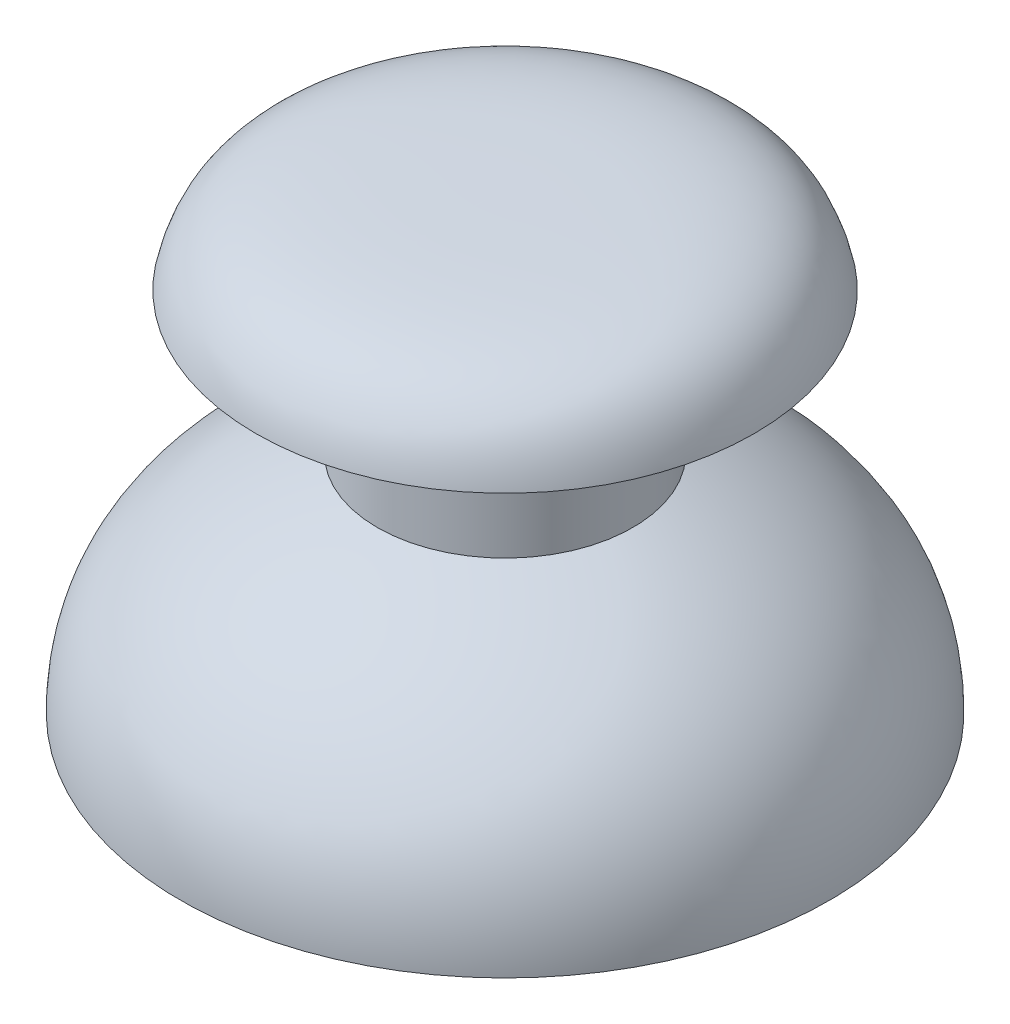
ISO-10303-21;
HEADER;
FILE_DESCRIPTION(('STEP AP214'),'2;1');
FILE_NAME('part.step','',(''),(''),'','','');
FILE_SCHEMA(('AUTOMOTIVE_DESIGN { 1 0 10303 214 1 1 1 1 }'));
ENDSEC;
DATA;
#1=APPLICATION_CONTEXT('core data for automotive mechanical design processes');
#2=APPLICATION_PROTOCOL_DEFINITION('international standard','automotive_design',2000,#1);
#3=PRODUCT_CONTEXT('',#1,'mechanical');
#4=PRODUCT('Part','Part','',(#3));
#5=PRODUCT_RELATED_PRODUCT_CATEGORY('part','',(#4));
#6=PRODUCT_DEFINITION_FORMATION('','',#4);
#7=PRODUCT_DEFINITION_CONTEXT('part definition',#1,'design');
#8=PRODUCT_DEFINITION('design','',#6,#7);
#9=PRODUCT_DEFINITION_SHAPE('','',#8);
#10=(LENGTH_UNIT() NAMED_UNIT(*) SI_UNIT(.MILLI.,.METRE.));
#11=(NAMED_UNIT(*) PLANE_ANGLE_UNIT() SI_UNIT($,.RADIAN.));
#12=(NAMED_UNIT(*) SI_UNIT($,.STERADIAN.) SOLID_ANGLE_UNIT());
#13=UNCERTAINTY_MEASURE_WITH_UNIT(LENGTH_MEASURE(1.E-05),#10,'distance_accuracy_value','');
#14=(GEOMETRIC_REPRESENTATION_CONTEXT(3) GLOBAL_UNCERTAINTY_ASSIGNED_CONTEXT((#13)) GLOBAL_UNIT_ASSIGNED_CONTEXT((#10,
#11,#12)) REPRESENTATION_CONTEXT('',''));
#15=CARTESIAN_POINT('',(0.,0.,0.));
#16=DIRECTION('',(0.,0.,1.));
#17=DIRECTION('',(1.,0.,0.));
#18=AXIS2_PLACEMENT_3D('',#15,#16,#17);
#19=CARTESIAN_POINT('',(0.,8.93607267068107,4.28417266486361));
#20=CARTESIAN_POINT('',(0.,8.85738178045405,4.50611510990907));
#21=CARTESIAN_POINT('',(0.,8.77869089022702,4.72805755495454));
#22=CARTESIAN_POINT('',(0.,8.7,4.95));
#23=CARTESIAN_POINT('',(0.,7.34033976746877,8.78483165037869));
#24=CARTESIAN_POINT('',(0.,4.78192588649418,12.5687261289951));
#25=CARTESIAN_POINT('',(0.,0.,12.5687261289951));
#26=B_SPLINE_CURVE_WITH_KNOTS('',3,(#19,#20,#21,#22,#23,#24,#25),.UNSPECIFIED.,.F.,.F.,(4,3,4),
(-0.0578754076527833,0.,1.),.UNSPECIFIED.);
#27=CARTESIAN_POINT('',(0.,0.,0.));
#28=DIRECTION('',(0.,-1.,0.));
#29=AXIS1_PLACEMENT('',#27,#28);
#30=SURFACE_OF_REVOLUTION('',#26,#29);
#31=CARTESIAN_POINT('',(0.,0.,0.));
#32=DIRECTION('',(0.,-1.,0.));
#33=DIRECTION('',(0.,0.,-1.));
#34=AXIS2_PLACEMENT_3D('',#31,#32,#33);
#35=CIRCLE('',#34,12.5687261289951);
#36=CARTESIAN_POINT('',(0.,0.,-12.5687261289951));
#37=VERTEX_POINT('',#36);
#38=EDGE_CURVE('E75',#37,#37,#35,.T.);
#39=ORIENTED_EDGE('',*,*,#38,.F.);
#40=EDGE_LOOP('',(#39));
#41=FACE_BOUND('',#40,.T.);
#42=CARTESIAN_POINT('',(0.,8.7,0.));
#43=DIRECTION('',(0.,-1.,0.));
#44=DIRECTION('',(0.,0.,-1.));
#45=AXIS2_PLACEMENT_3D('',#42,#43,#44);
#46=CIRCLE('',#45,4.95);
#47=CARTESIAN_POINT('',(0.,8.7,-4.95));
#48=VERTEX_POINT('',#47);
#49=EDGE_CURVE('E11',#48,#48,#46,.T.);
#50=ORIENTED_EDGE('',*,*,#49,.T.);
#51=EDGE_LOOP('',(#50));
#52=FACE_BOUND('',#51,.T.);
#53=ADVANCED_FACE('F16',(#41,#52),#30,.T.);
#54=CARTESIAN_POINT('',(0.,0.,0.));
#55=DIRECTION('',(0.,-1.,0.));
#56=DIRECTION('',(0.,0.,-1.));
#57=AXIS2_PLACEMENT_3D('',#54,#55,#56);
#58=CYLINDRICAL_SURFACE('',#57,4.95);
#59=ORIENTED_EDGE('',*,*,#49,.F.);
#60=EDGE_LOOP('',(#59));
#61=FACE_BOUND('',#60,.T.);
#62=CARTESIAN_POINT('',(0.,13.7,0.));
#63=DIRECTION('',(0.,-1.,0.));
#64=DIRECTION('',(0.,0.,-1.));
#65=AXIS2_PLACEMENT_3D('',#62,#63,#64);
#66=CIRCLE('',#65,4.95);
#67=CARTESIAN_POINT('',(0.,13.7,-4.95));
#68=VERTEX_POINT('',#67);
#69=EDGE_CURVE('E24',#68,#68,#66,.T.);
#70=ORIENTED_EDGE('',*,*,#69,.T.);
#71=EDGE_LOOP('',(#70));
#72=FACE_BOUND('',#71,.T.);
#73=ADVANCED_FACE('F18',(#61,#72),#58,.T.);
#74=CARTESIAN_POINT('',(0.,14.2,0.));
#75=DIRECTION('',(0.,1.,0.));
#76=DIRECTION('',(0.,0.,1.));
#77=AXIS2_PLACEMENT_3D('',#74,#75,#76);
#78=CONICAL_SURFACE('',#77,9.65,1.4648119688053);
#79=ORIENTED_EDGE('',*,*,#69,.F.);
#80=EDGE_LOOP('',(#79));
#81=FACE_BOUND('',#80,.T.);
#82=CARTESIAN_POINT('',(0.,14.2,0.));
#83=DIRECTION('',(0.,-1.,0.));
#84=DIRECTION('',(0.,0.,-1.));
#85=AXIS2_PLACEMENT_3D('',#82,#83,#84);
#86=CIRCLE('',#85,9.65);
#87=CARTESIAN_POINT('',(0.,14.2,-9.65));
#88=VERTEX_POINT('',#87);
#89=EDGE_CURVE('E99',#88,#88,#86,.T.);
#90=ORIENTED_EDGE('',*,*,#89,.T.);
#91=EDGE_LOOP('',(#90));
#92=FACE_BOUND('',#91,.T.);
#93=ADVANCED_FACE('F52',(#81,#92),#78,.T.);
#94=CARTESIAN_POINT('',(0.,17.6,0.));
#95=CARTESIAN_POINT('',(0.,17.6,6.20469093630731));
#96=CARTESIAN_POINT('',(0.,17.5655279296969,8.93688542802643));
#97=CARTESIAN_POINT('',(0.,14.2,9.65));
#98=B_SPLINE_CURVE_WITH_KNOTS('',3,(#94,#95,#96,#97),.UNSPECIFIED.,.F.,.F.,(4,4),(0.,1.),.UNSPECIFIED.);
#99=CARTESIAN_POINT('',(0.,0.,0.));
#100=DIRECTION('',(0.,-1.,0.));
#101=AXIS1_PLACEMENT('',#99,#100);
#102=SURFACE_OF_REVOLUTION('',#98,#101);
#103=ORIENTED_EDGE('',*,*,#89,.F.);
#104=EDGE_LOOP('',(#103));
#105=FACE_BOUND('',#104,.T.);
#106=CARTESIAN_POINT('',(0.,17.6,0.));
#107=VERTEX_POINT('',#106);
#108=VERTEX_LOOP('',#107);
#109=FACE_BOUND('',#108,.T.);
#110=ADVANCED_FACE('F80',(#105,#109),#102,.T.);
#111=CARTESIAN_POINT('',(0.,0.,12.5687261289951));
#112=DIRECTION('',(0.,1.,0.));
#113=DIRECTION('',(0.,0.,1.));
#114=AXIS2_PLACEMENT_3D('',#111,#112,#113);
#115=PLANE('',#114);
#116=CARTESIAN_POINT('',(0.,0.,0.));
#117=DIRECTION('',(0.,-1.,0.));
#118=DIRECTION('',(0.,0.,-1.));
#119=AXIS2_PLACEMENT_3D('',#116,#117,#118);
#120=CIRCLE('',#119,11.5687261289951);
#121=CARTESIAN_POINT('',(0.,0.,-11.5687261289951));
#122=VERTEX_POINT('',#121);
#123=EDGE_CURVE('E66',#122,#122,#120,.T.);
#124=ORIENTED_EDGE('',*,*,#123,.F.);
#125=EDGE_LOOP('',(#124));
#126=FACE_BOUND('',#125,.T.);
#127=ORIENTED_EDGE('',*,*,#38,.T.);
#128=EDGE_LOOP('',(#127));
#129=FACE_BOUND('',#128,.T.);
#130=ADVANCED_FACE('F84',(#126,#129),#115,.F.);
#131=CARTESIAN_POINT('',(0.,8.93607267068107,4.28417266486361));
#132=CARTESIAN_POINT('',(0.,8.85738178045405,4.50611510990907));
#133=CARTESIAN_POINT('',(0.,8.77869089022702,4.72805755495454));
#134=CARTESIAN_POINT('',(0.,7.34033976746877,8.78483165037869));
#135=CARTESIAN_POINT('',(0.,4.78192588649418,12.5687261289951));
#136=CARTESIAN_POINT('',(0.,0.,12.5687261289951));
#137=B_SPLINE_CURVE_WITH_KNOTS('',3,(#131,#132,#133,#134,#135,#136),.UNSPECIFIED.,.F.,.F.,(4,2,
4),(-0.0578754076527833,0.,1.),.UNSPECIFIED.);
#138=CARTESIAN_POINT('',(0.,0.,0.));
#139=DIRECTION('',(0.,-1.,0.));
#140=AXIS1_PLACEMENT('',#138,#139);
#141=SURFACE_OF_REVOLUTION('',#137,#140);
#142=OFFSET_SURFACE('',#141,-1.,.F.);
#143=ORIENTED_EDGE('',*,*,#123,.T.);
#144=EDGE_LOOP('',(#143));
#145=FACE_BOUND('',#144,.T.);
#146=CARTESIAN_POINT('',(0.,7.99356079804606,0.));
#147=DIRECTION('',(0.,-1.,0.));
#148=DIRECTION('',(0.,0.,-1.));
#149=AXIS2_PLACEMENT_3D('',#146,#147,#148);
#150=CIRCLE('',#149,3.95);
#151=CARTESIAN_POINT('',(0.,7.99356079804606,-3.95));
#152=VERTEX_POINT('',#151);
#153=EDGE_CURVE('E101',#152,#152,#150,.T.);
#154=ORIENTED_EDGE('',*,*,#153,.F.);
#155=EDGE_LOOP('',(#154));
#156=FACE_BOUND('',#155,.T.);
#157=ADVANCED_FACE('F60',(#145,#156),#142,.F.);
#158=CARTESIAN_POINT('',(0.,0.,0.));
#159=DIRECTION('',(0.,-1.,0.));
#160=DIRECTION('',(0.,0.,-1.));
#161=AXIS2_PLACEMENT_3D('',#158,#159,#160);
#162=CYLINDRICAL_SURFACE('',#161,3.95);
#163=ORIENTED_EDGE('',*,*,#153,.T.);
#164=EDGE_LOOP('',(#163));
#165=FACE_BOUND('',#164,.T.);
#166=CARTESIAN_POINT('',(0.,14.5992597700508,0.));
#167=DIRECTION('',(0.,1.,0.));
#168=DIRECTION('',(0.,0.,1.));
#169=AXIS2_PLACEMENT_3D('',#166,#167,#168);
#170=CIRCLE('',#169,3.95);
#171=CARTESIAN_POINT('',(0.,14.5992597700508,3.95));
#172=VERTEX_POINT('',#171);
#173=EDGE_CURVE('E104',#172,#172,#170,.F.);
#174=ORIENTED_EDGE('',*,*,#173,.F.);
#175=EDGE_LOOP('',(#174));
#176=FACE_BOUND('',#175,.T.);
#177=ADVANCED_FACE('F40',(#165,#176),#162,.F.);
#178=CARTESIAN_POINT('',(0.,15.1943889131791,0.));
#179=DIRECTION('',(0.,1.,0.));
#180=DIRECTION('',(0.,0.,1.));
#181=AXIS2_PLACEMENT_3D('',#178,#179,#180);
#182=CONICAL_SURFACE('',#181,9.54421394540648,1.4648119688053);
#183=ORIENTED_EDGE('',*,*,#173,.T.);
#184=EDGE_LOOP('',(#183));
#185=FACE_BOUND('',#184,.T.);
#186=CARTESIAN_POINT('',(0.,15.0607366533768,0.));
#187=DIRECTION('',(0.,-1.,0.));
#188=DIRECTION('',(0.,0.,-1.));
#189=AXIS2_PLACEMENT_3D('',#186,#187,#188);
#190=CIRCLE('',#189,8.28788270326431);
#191=CARTESIAN_POINT('',(0.,15.0607366533768,-8.28788270326431));
#192=VERTEX_POINT('',#191);
#193=EDGE_CURVE('E109',#192,#192,#190,.T.);
#194=ORIENTED_EDGE('',*,*,#193,.F.);
#195=EDGE_LOOP('',(#194));
#196=FACE_BOUND('',#195,.T.);
#197=ADVANCED_FACE('F32',(#185,#196),#182,.F.);
#198=CARTESIAN_POINT('',(0.,17.6,0.));
#199=CARTESIAN_POINT('',(0.,17.6,6.20469093630731));
#200=CARTESIAN_POINT('',(0.,17.5655279296969,8.93688542802643));
#201=CARTESIAN_POINT('',(0.,14.2,9.65));
#202=B_SPLINE_CURVE_WITH_KNOTS('',3,(#198,#199,#200,#201),.UNSPECIFIED.,.F.,.F.,(4,4),(0.,1.),.UNSPECIFIED.);
#203=CARTESIAN_POINT('',(0.,0.,0.));
#204=DIRECTION('',(0.,-1.,0.));
#205=AXIS1_PLACEMENT('',#203,#204);
#206=SURFACE_OF_REVOLUTION('',#202,#205);
#207=OFFSET_SURFACE('',#206,-1.,.F.);
#208=ORIENTED_EDGE('',*,*,#193,.T.);
#209=EDGE_LOOP('',(#208));
#210=FACE_BOUND('',#209,.T.);
#211=CARTESIAN_POINT('',(0.,16.6,0.));
#212=VERTEX_POINT('',#211);
#213=VERTEX_LOOP('',#212);
#214=FACE_BOUND('',#213,.T.);
#215=ADVANCED_FACE('F30',(#210,#214),#207,.F.);
#216=CLOSED_SHELL('',(#53,#73,#93,#110,#130,#157,#177,#197,#215));
#217=MANIFOLD_SOLID_BREP('B1',#216);
#218=ADVANCED_BREP_SHAPE_REPRESENTATION('',(#18,#217),#14);
#219=SHAPE_DEFINITION_REPRESENTATION(#9,#218);
ENDSEC;
END-ISO-10303-21;
